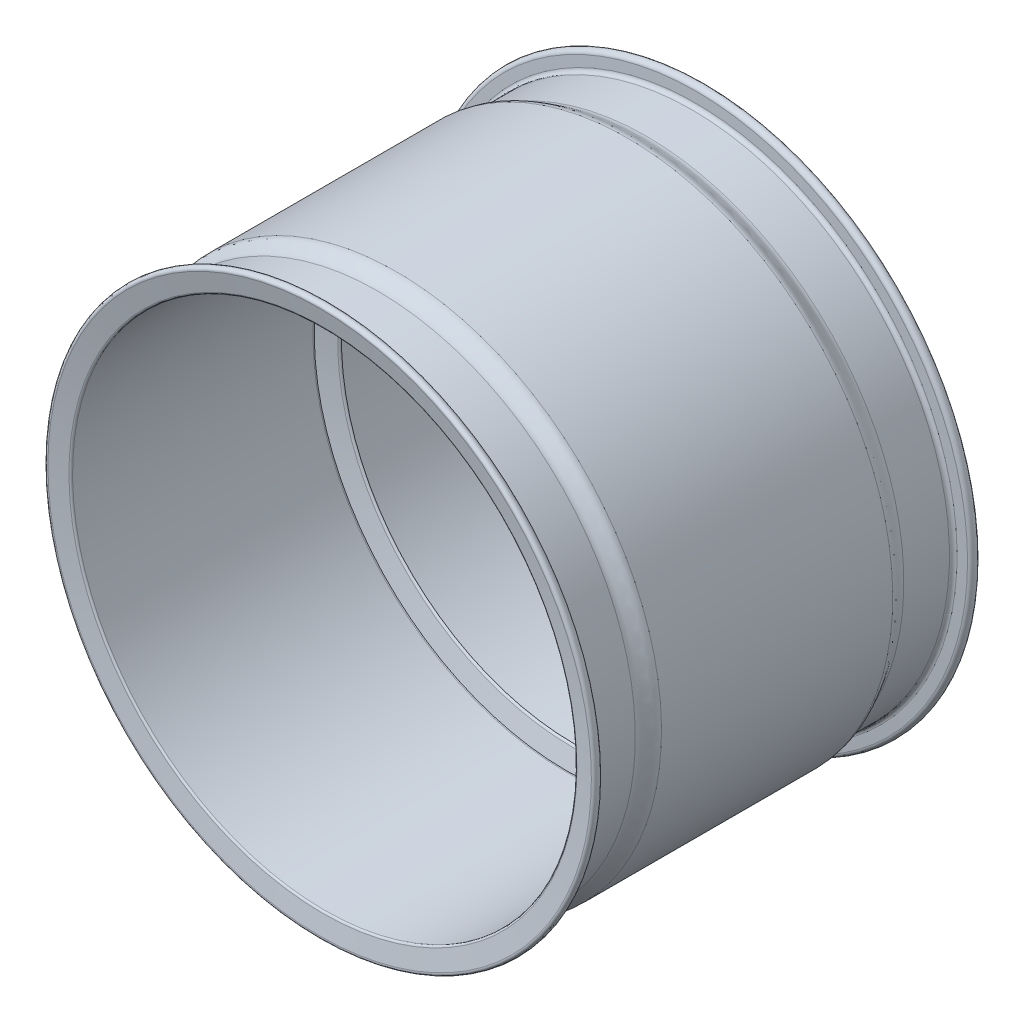
ISO-10303-21;
HEADER;
FILE_DESCRIPTION(('STEP AP214'),'2;1');
FILE_NAME('part.step','',(''),(''),'','','');
FILE_SCHEMA(('AUTOMOTIVE_DESIGN { 1 0 10303 214 1 1 1 1 }'));
ENDSEC;
DATA;
#1=APPLICATION_CONTEXT('core data for automotive mechanical design processes');
#2=APPLICATION_PROTOCOL_DEFINITION('international standard','automotive_design',2000,#1);
#3=PRODUCT_CONTEXT('',#1,'mechanical');
#4=PRODUCT('Part','Part','',(#3));
#5=PRODUCT_RELATED_PRODUCT_CATEGORY('part','',(#4));
#6=PRODUCT_DEFINITION_FORMATION('','',#4);
#7=PRODUCT_DEFINITION_CONTEXT('part definition',#1,'design');
#8=PRODUCT_DEFINITION('design','',#6,#7);
#9=PRODUCT_DEFINITION_SHAPE('','',#8);
#10=(LENGTH_UNIT() NAMED_UNIT(*) SI_UNIT(.MILLI.,.METRE.));
#11=(NAMED_UNIT(*) PLANE_ANGLE_UNIT() SI_UNIT($,.RADIAN.));
#12=(NAMED_UNIT(*) SI_UNIT($,.STERADIAN.) SOLID_ANGLE_UNIT());
#13=UNCERTAINTY_MEASURE_WITH_UNIT(LENGTH_MEASURE(1.E-05),#10,'distance_accuracy_value','');
#14=(GEOMETRIC_REPRESENTATION_CONTEXT(3) GLOBAL_UNCERTAINTY_ASSIGNED_CONTEXT((#13)) GLOBAL_UNIT_ASSIGNED_CONTEXT((#10,
#11,#12)) REPRESENTATION_CONTEXT('',''));
#15=CARTESIAN_POINT('',(0.,0.,0.));
#16=DIRECTION('',(0.,0.,1.));
#17=DIRECTION('',(1.,0.,0.));
#18=AXIS2_PLACEMENT_3D('',#15,#16,#17);
#19=CARTESIAN_POINT('',(-7927.40763591954,2848.66816357867,1107.69743971437));
#20=DIRECTION('',(0.,0.,-1.));
#21=DIRECTION('',(0.,-1.,0.));
#22=AXIS2_PLACEMENT_3D('',#19,#20,#21);
#23=CYLINDRICAL_SURFACE('',#22,872.626729216628);
#24=CARTESIAN_POINT('',(-7927.40763591954,2848.66816357867,313.603993632309));
#25=DIRECTION('',(0.,0.,1.));
#26=DIRECTION('',(0.,-1.,0.));
#27=AXIS2_PLACEMENT_3D('',#24,#25,#26);
#28=CIRCLE('',#27,872.626729216631);
#29=CARTESIAN_POINT('',(-7927.40763591954,1976.04143436204,313.603993632309));
#30=VERTEX_POINT('',#29);
#31=EDGE_CURVE('E10',#30,#30,#28,.T.);
#32=ORIENTED_EDGE('',*,*,#31,.F.);
#33=EDGE_LOOP('',(#32));
#34=FACE_BOUND('',#33,.T.);
#35=CARTESIAN_POINT('',(-7927.40763591954,2848.66816357867,1145.27715660501));
#36=DIRECTION('',(0.,0.,1.));
#37=DIRECTION('',(0.,-1.,0.));
#38=AXIS2_PLACEMENT_3D('',#35,#36,#37);
#39=CIRCLE('',#38,872.626729216626);
#40=CARTESIAN_POINT('',(-7927.40763591954,1976.04143436205,1145.27715660501));
#41=VERTEX_POINT('',#40);
#42=EDGE_CURVE('E217',#41,#41,#39,.T.);
#43=ORIENTED_EDGE('',*,*,#42,.T.);
#44=EDGE_LOOP('',(#43));
#45=FACE_BOUND('',#44,.T.);
#46=ADVANCED_FACE('F15',(#34,#45),#23,.F.);
#47=CARTESIAN_POINT('',(-7927.40763591954,2848.66816357867,313.603993632309));
#48=DIRECTION('',(0.,0.,1.));
#49=DIRECTION('',(0.,1.,0.));
#50=AXIS2_PLACEMENT_3D('',#47,#48,#49);
#51=CONICAL_SURFACE('',#50,872.626729216631,0.0244340149573436);
#52=CARTESIAN_POINT('',(-7927.40763591954,2848.66816357867,309.257603664303));
#53=DIRECTION('',(0.,0.,1.));
#54=DIRECTION('',(0.,-1.,0.));
#55=AXIS2_PLACEMENT_3D('',#52,#53,#54);
#56=CIRCLE('',#55,872.520508319595);
#57=CARTESIAN_POINT('',(-7927.40763591954,1976.14765525908,309.257603664303));
#58=VERTEX_POINT('',#57);
#59=EDGE_CURVE('E21',#58,#58,#56,.T.);
#60=ORIENTED_EDGE('',*,*,#59,.F.);
#61=EDGE_LOOP('',(#60));
#62=FACE_BOUND('',#61,.T.);
#63=ORIENTED_EDGE('',*,*,#31,.T.);
#64=EDGE_LOOP('',(#63));
#65=FACE_BOUND('',#64,.T.);
#66=ADVANCED_FACE('F208',(#62,#65),#51,.F.);
#67=CARTESIAN_POINT('',(-7927.40763591954,2848.66816357867,290.539523024188));
#68=DIRECTION('',(0.,0.,1.));
#69=DIRECTION('',(0.,1.,0.));
#70=AXIS2_PLACEMENT_3D('',#67,#68,#69);
#71=CONICAL_SURFACE('',#70,809.981708308582,1.27997866155326);
#72=ORIENTED_EDGE('',*,*,#59,.T.);
#73=EDGE_LOOP('',(#72));
#74=FACE_BOUND('',#73,.T.);
#75=CARTESIAN_POINT('',(-7927.40763591954,2848.66816357867,290.539523024188));
#76=DIRECTION('',(0.,0.,1.));
#77=DIRECTION('',(0.,-1.,0.));
#78=AXIS2_PLACEMENT_3D('',#75,#76,#77);
#79=CIRCLE('',#78,809.981708308582);
#80=CARTESIAN_POINT('',(-7927.40763591954,2038.68645527009,290.539523024188));
#81=VERTEX_POINT('',#80);
#82=EDGE_CURVE('E25',#81,#81,#79,.T.);
#83=ORIENTED_EDGE('',*,*,#82,.F.);
#84=EDGE_LOOP('',(#83));
#85=FACE_BOUND('',#84,.T.);
#86=ADVANCED_FACE('F139',(#74,#85),#71,.F.);
#87=CARTESIAN_POINT('',(-7927.40763591954,3658.64987188726,290.539523024188));
#88=CARTESIAN_POINT('',(-7927.40763591954,3654.97252343434,289.438879825545));
#89=CARTESIAN_POINT('',(-7927.40763591954,3650.45167821207,283.536212592688));
#90=CARTESIAN_POINT('',(-7927.40763591954,3653.8595859903,282.71538319234));
#91=B_SPLINE_CURVE_WITH_KNOTS('',3,(#87,#88,#89,#90),.UNSPECIFIED.,.F.,.F.,(4,4),(0.,1.),.UNSPECIFIED.);
#92=CARTESIAN_POINT('',(-7927.40763591954,2848.66816357867,1107.69743971437));
#93=DIRECTION('',(0.,0.,-1.));
#94=AXIS1_PLACEMENT('',#92,#93);
#95=SURFACE_OF_REVOLUTION('',#91,#94);
#96=CARTESIAN_POINT('',(-7927.40763591954,2848.66816357867,282.71538319234));
#97=DIRECTION('',(0.,0.,1.));
#98=DIRECTION('',(0.,-1.,0.));
#99=AXIS2_PLACEMENT_3D('',#96,#97,#98);
#100=CIRCLE('',#99,805.191422411616);
#101=CARTESIAN_POINT('',(-7927.40763591954,2043.47674116706,282.71538319234));
#102=VERTEX_POINT('',#101);
#103=EDGE_CURVE('E29',#102,#102,#100,.T.);
#104=ORIENTED_EDGE('',*,*,#103,.F.);
#105=EDGE_LOOP('',(#104));
#106=FACE_BOUND('',#105,.T.);
#107=ORIENTED_EDGE('',*,*,#82,.T.);
#108=EDGE_LOOP('',(#107));
#109=FACE_BOUND('',#108,.T.);
#110=ADVANCED_FACE('F135',(#106,#109),#95,.F.);
#111=CARTESIAN_POINT('',(-7927.40763591954,2848.66816357867,270.937208748419));
#112=DIRECTION('',(0.,0.,-1.));
#113=DIRECTION('',(0.,-1.,0.));
#114=AXIS2_PLACEMENT_3D('',#111,#112,#113);
#115=CONICAL_SURFACE('',#114,854.091878808233,1.33443813978017);
#116=ORIENTED_EDGE('',*,*,#103,.T.);
#117=EDGE_LOOP('',(#116));
#118=FACE_BOUND('',#117,.T.);
#119=CARTESIAN_POINT('',(-7927.40763591954,2848.66816357867,270.937208748419));
#120=DIRECTION('',(0.,0.,1.));
#121=DIRECTION('',(0.,-1.,0.));
#122=AXIS2_PLACEMENT_3D('',#119,#120,#121);
#123=CIRCLE('',#122,854.091878808233);
#124=CARTESIAN_POINT('',(-7927.40763591954,1994.57628477044,270.937208748419));
#125=VERTEX_POINT('',#124);
#126=EDGE_CURVE('E34',#125,#125,#123,.T.);
#127=ORIENTED_EDGE('',*,*,#126,.F.);
#128=EDGE_LOOP('',(#127));
#129=FACE_BOUND('',#128,.T.);
#130=ADVANCED_FACE('F131',(#118,#129),#115,.F.);
#131=CARTESIAN_POINT('',(-7927.40763591954,3702.76004238691,270.937208748419));
#132=CARTESIAN_POINT('',(-7927.40763591954,3712.77494822842,268.525016373697));
#133=CARTESIAN_POINT('',(-7927.40763591954,3721.2948927953,261.567860627973));
#134=CARTESIAN_POINT('',(-7927.40763591954,3721.2948927953,252.007999820701));
#135=B_SPLINE_CURVE_WITH_KNOTS('',3,(#131,#132,#133,#134),.UNSPECIFIED.,.F.,.F.,(4,4),(0.,1.),.UNSPECIFIED.);
#136=CARTESIAN_POINT('',(-7927.40763591954,2848.66816357867,1107.69743971437));
#137=DIRECTION('',(0.,0.,-1.));
#138=AXIS1_PLACEMENT('',#136,#137);
#139=SURFACE_OF_REVOLUTION('',#135,#138);
#140=CARTESIAN_POINT('',(-7927.40763591954,2848.66816357867,252.007999820701));
#141=DIRECTION('',(0.,0.,1.));
#142=DIRECTION('',(0.,-1.,0.));
#143=AXIS2_PLACEMENT_3D('',#140,#141,#142);
#144=CIRCLE('',#143,872.626729216628);
#145=CARTESIAN_POINT('',(-7927.40763591954,1976.04143436205,252.007999820701));
#146=VERTEX_POINT('',#145);
#147=EDGE_CURVE('E37',#146,#146,#144,.T.);
#148=ORIENTED_EDGE('',*,*,#147,.F.);
#149=EDGE_LOOP('',(#148));
#150=FACE_BOUND('',#149,.T.);
#151=ORIENTED_EDGE('',*,*,#126,.T.);
#152=EDGE_LOOP('',(#151));
#153=FACE_BOUND('',#152,.T.);
#154=ADVANCED_FACE('F127',(#150,#153),#139,.F.);
#155=CARTESIAN_POINT('',(-7927.40763591954,2848.66816357867,1107.69743971437));
#156=DIRECTION('',(0.,0.,-1.));
#157=DIRECTION('',(0.,-1.,0.));
#158=AXIS2_PLACEMENT_3D('',#155,#156,#157);
#159=CYLINDRICAL_SURFACE('',#158,872.626729216626);
#160=CARTESIAN_POINT('',(-7927.40763591954,2848.66816357867,-149.90753450565));
#161=DIRECTION('',(0.,0.,1.));
#162=DIRECTION('',(0.,-1.,0.));
#163=AXIS2_PLACEMENT_3D('',#160,#161,#162);
#164=CIRCLE('',#163,872.626729216624);
#165=CARTESIAN_POINT('',(-7927.40763591954,1976.04143436205,-149.90753450565));
#166=VERTEX_POINT('',#165);
#167=EDGE_CURVE('E40',#166,#166,#164,.T.);
#168=ORIENTED_EDGE('',*,*,#167,.F.);
#169=EDGE_LOOP('',(#168));
#170=FACE_BOUND('',#169,.T.);
#171=ORIENTED_EDGE('',*,*,#147,.T.);
#172=EDGE_LOOP('',(#171));
#173=FACE_BOUND('',#172,.T.);
#174=ADVANCED_FACE('F123',(#170,#173),#159,.F.);
#175=CARTESIAN_POINT('',(-7927.40763591954,3727.32924383285,-156.358850884272));
#176=CARTESIAN_POINT('',(-7927.40763591954,3723.98355823629,-155.734322906248));
#177=CARTESIAN_POINT('',(-7927.40763591954,3721.2948927953,-153.169237991303));
#178=CARTESIAN_POINT('',(-7927.40763591954,3721.2948927953,-149.90753450565));
#179=B_SPLINE_CURVE_WITH_KNOTS('',3,(#175,#176,#177,#178),.UNSPECIFIED.,.F.,.F.,(4,4),(0.,1.),.UNSPECIFIED.);
#180=CARTESIAN_POINT('',(-7927.40763591954,2848.66816357867,1107.69743971437));
#181=DIRECTION('',(0.,0.,-1.));
#182=AXIS1_PLACEMENT('',#180,#181);
#183=SURFACE_OF_REVOLUTION('',#179,#182);
#184=ORIENTED_EDGE('',*,*,#167,.T.);
#185=EDGE_LOOP('',(#184));
#186=FACE_BOUND('',#185,.T.);
#187=CARTESIAN_POINT('',(-7927.40763591954,2848.66816357867,-156.358850884272));
#188=DIRECTION('',(0.,0.,1.));
#189=DIRECTION('',(0.,-1.,0.));
#190=AXIS2_PLACEMENT_3D('',#187,#188,#189);
#191=CIRCLE('',#190,878.661080254166);
#192=CARTESIAN_POINT('',(-7927.40763591954,1970.00708332451,-156.358850884272));
#193=VERTEX_POINT('',#192);
#194=EDGE_CURVE('E43',#193,#193,#191,.T.);
#195=ORIENTED_EDGE('',*,*,#194,.F.);
#196=EDGE_LOOP('',(#195));
#197=FACE_BOUND('',#196,.T.);
#198=ADVANCED_FACE('F120',(#186,#197),#183,.T.);
#199=CARTESIAN_POINT('',(-7927.40763591954,2848.66816357867,-156.358850884272));
#200=DIRECTION('',(0.,0.,-1.));
#201=DIRECTION('',(0.,-1.,0.));
#202=AXIS2_PLACEMENT_3D('',#199,#200,#201);
#203=CONICAL_SURFACE('',#202,878.661080254166,1.38625352960428);
#204=CARTESIAN_POINT('',(-7927.40763591954,2848.66816357867,-167.815188950199));
#205=DIRECTION('',(0.,0.,1.));
#206=DIRECTION('',(0.,-1.,0.));
#207=AXIS2_PLACEMENT_3D('',#204,#205,#206);
#208=CIRCLE('',#207,940.034319893063);
#209=CARTESIAN_POINT('',(-7927.40763591954,1908.63384368561,-167.815188950199));
#210=VERTEX_POINT('',#209);
#211=EDGE_CURVE('E46',#210,#210,#208,.T.);
#212=ORIENTED_EDGE('',*,*,#211,.F.);
#213=EDGE_LOOP('',(#212));
#214=FACE_BOUND('',#213,.T.);
#215=ORIENTED_EDGE('',*,*,#194,.T.);
#216=EDGE_LOOP('',(#215));
#217=FACE_BOUND('',#216,.T.);
#218=ADVANCED_FACE('F99',(#214,#217),#203,.F.);
#219=CARTESIAN_POINT('',(-7927.40763591954,3787.38225023844,-139.523187611277));
#220=CARTESIAN_POINT('',(-7927.40763591954,3805.32306820624,-140.434467254083));
#221=CARTESIAN_POINT('',(-7927.40763591954,3805.61899329388,-170.972937450326));
#222=CARTESIAN_POINT('',(-7927.40763591954,3788.70248347174,-167.815188950199));
#223=B_SPLINE_CURVE_WITH_KNOTS('',3,(#219,#220,#221,#222),.UNSPECIFIED.,.F.,.F.,(4,4),(0.,1.),.UNSPECIFIED.);
#224=CARTESIAN_POINT('',(-7927.40763591954,2848.66816357867,1107.69743971437));
#225=DIRECTION('',(0.,0.,-1.));
#226=AXIS1_PLACEMENT('',#224,#225);
#227=SURFACE_OF_REVOLUTION('',#223,#226);
#228=ORIENTED_EDGE('',*,*,#211,.T.);
#229=EDGE_LOOP('',(#228));
#230=FACE_BOUND('',#229,.T.);
#231=CARTESIAN_POINT('',(-7927.40763591954,2848.66816357867,-139.523187611277));
#232=DIRECTION('',(0.,0.,1.));
#233=DIRECTION('',(0.,-1.,0.));
#234=AXIS2_PLACEMENT_3D('',#231,#232,#233);
#235=CIRCLE('',#234,938.714086659763);
#236=CARTESIAN_POINT('',(-7927.40763591954,1909.95407691891,-139.523187611277));
#237=VERTEX_POINT('',#236);
#238=EDGE_CURVE('E49',#237,#237,#235,.T.);
#239=ORIENTED_EDGE('',*,*,#238,.F.);
#240=EDGE_LOOP('',(#239));
#241=FACE_BOUND('',#240,.T.);
#242=ADVANCED_FACE('F95',(#230,#241),#227,.T.);
#243=CARTESIAN_POINT('',(-7927.40763591954,2848.66816357867,-139.523187611277));
#244=DIRECTION('',(0.,0.,-1.));
#245=DIRECTION('',(0.,-1.,0.));
#246=AXIS2_PLACEMENT_3D('',#243,#244,#245);
#247=CONICAL_SURFACE('',#246,938.714086659763,1.52004629095966);
#248=CARTESIAN_POINT('',(-7927.40763591954,2848.66816357867,-137.770631838097));
#249=DIRECTION('',(0.,0.,1.));
#250=DIRECTION('',(0.,-1.,0.));
#251=AXIS2_PLACEMENT_3D('',#248,#249,#250);
#252=CIRCLE('',#251,904.210644875272);
#253=CARTESIAN_POINT('',(-7927.40763591954,1944.4575187034,-137.770631838097));
#254=VERTEX_POINT('',#253);
#255=EDGE_CURVE('E52',#254,#254,#252,.T.);
#256=ORIENTED_EDGE('',*,*,#255,.F.);
#257=EDGE_LOOP('',(#256));
#258=FACE_BOUND('',#257,.T.);
#259=ORIENTED_EDGE('',*,*,#238,.T.);
#260=EDGE_LOOP('',(#259));
#261=FACE_BOUND('',#260,.T.);
#262=ADVANCED_FACE('F91',(#258,#261),#247,.T.);
#263=CARTESIAN_POINT('',(-7927.40763591954,3739.73464015509,-124.501280984016));
#264=CARTESIAN_POINT('',(-7927.40763591954,3739.73464015509,-131.661971573417));
#265=CARTESIAN_POINT('',(-7927.40763591954,3745.60846408455,-137.401344505042));
#266=CARTESIAN_POINT('',(-7927.40763591954,3752.87880845395,-137.770631838097));
#267=B_SPLINE_CURVE_WITH_KNOTS('',3,(#263,#264,#265,#266),.UNSPECIFIED.,.F.,.F.,(4,4),(0.,1.),.UNSPECIFIED.);
#268=CARTESIAN_POINT('',(-7927.40763591954,2848.66816357867,1107.69743971437));
#269=DIRECTION('',(0.,0.,-1.));
#270=AXIS1_PLACEMENT('',#268,#269);
#271=SURFACE_OF_REVOLUTION('',#267,#270);
#272=ORIENTED_EDGE('',*,*,#255,.T.);
#273=EDGE_LOOP('',(#272));
#274=FACE_BOUND('',#273,.T.);
#275=CARTESIAN_POINT('',(-7927.40763591954,2848.66816357867,-124.501280984016));
#276=DIRECTION('',(0.,0.,1.));
#277=DIRECTION('',(0.,-1.,0.));
#278=AXIS2_PLACEMENT_3D('',#275,#276,#277);
#279=CIRCLE('',#278,891.066476576418);
#280=CARTESIAN_POINT('',(-7927.40763591954,1957.60168700226,-124.501280984016));
#281=VERTEX_POINT('',#280);
#282=EDGE_CURVE('E55',#281,#281,#279,.T.);
#283=ORIENTED_EDGE('',*,*,#282,.F.);
#284=EDGE_LOOP('',(#283));
#285=FACE_BOUND('',#284,.T.);
#286=ADVANCED_FACE('F87',(#274,#285),#271,.T.);
#287=CARTESIAN_POINT('',(-7927.40763591954,2848.66816357867,1107.69743971437));
#288=DIRECTION('',(0.,0.,-1.));
#289=DIRECTION('',(0.,-1.,0.));
#290=AXIS2_PLACEMENT_3D('',#287,#288,#289);
#291=CYLINDRICAL_SURFACE('',#290,891.066476576418);
#292=CARTESIAN_POINT('',(-7927.40763591954,2848.66816357867,33.2786751773391));
#293=DIRECTION('',(0.,0.,1.));
#294=DIRECTION('',(0.,-1.,0.));
#295=AXIS2_PLACEMENT_3D('',#292,#293,#294);
#296=CIRCLE('',#295,891.066476576417);
#297=CARTESIAN_POINT('',(-7927.40763591954,1957.60168700226,33.2786751773391));
#298=VERTEX_POINT('',#297);
#299=EDGE_CURVE('E58',#298,#298,#296,.T.);
#300=ORIENTED_EDGE('',*,*,#299,.F.);
#301=EDGE_LOOP('',(#300));
#302=FACE_BOUND('',#301,.T.);
#303=ORIENTED_EDGE('',*,*,#282,.T.);
#304=EDGE_LOOP('',(#303));
#305=FACE_BOUND('',#304,.T.);
#306=ADVANCED_FACE('F82',(#302,#305),#291,.T.);
#307=CARTESIAN_POINT('',(-7927.40763591954,3765.8435271157,97.6467911776693));
#308=CARTESIAN_POINT('',(-7927.40763591954,3765.8435271157,73.6116479770272));
#309=CARTESIAN_POINT('',(-7927.40763591954,3739.73464015509,57.313818377982));
#310=CARTESIAN_POINT('',(-7927.40763591954,3739.73464015509,33.2786751773391));
#311=B_SPLINE_CURVE_WITH_KNOTS('',3,(#307,#308,#309,#310),.UNSPECIFIED.,.F.,.F.,(4,4),(0.,1.),.UNSPECIFIED.);
#312=CARTESIAN_POINT('',(-7927.40763591954,2848.66816357867,1107.69743971437));
#313=DIRECTION('',(0.,0.,-1.));
#314=AXIS1_PLACEMENT('',#312,#313);
#315=SURFACE_OF_REVOLUTION('',#311,#314);
#316=ORIENTED_EDGE('',*,*,#299,.T.);
#317=EDGE_LOOP('',(#316));
#318=FACE_BOUND('',#317,.T.);
#319=CARTESIAN_POINT('',(-7927.40763591954,2848.66816357867,97.6467911776693));
#320=DIRECTION('',(0.,0.,1.));
#321=DIRECTION('',(0.,-1.,0.));
#322=AXIS2_PLACEMENT_3D('',#319,#320,#321);
#323=CIRCLE('',#322,917.175363537015);
#324=CARTESIAN_POINT('',(-7927.40763591954,1931.49280004166,97.6467911776693));
#325=VERTEX_POINT('',#324);
#326=EDGE_CURVE('E61',#325,#325,#323,.T.);
#327=ORIENTED_EDGE('',*,*,#326,.F.);
#328=EDGE_LOOP('',(#327));
#329=FACE_BOUND('',#328,.T.);
#330=ADVANCED_FACE('F77',(#318,#329),#315,.T.);
#331=CARTESIAN_POINT('',(-7927.40763591954,2848.66816357867,1107.69743971437));
#332=DIRECTION('',(0.,0.,-1.));
#333=DIRECTION('',(0.,-1.,0.));
#334=AXIS2_PLACEMENT_3D('',#331,#332,#333);
#335=CYLINDRICAL_SURFACE('',#334,917.175363537016);
#336=ORIENTED_EDGE('',*,*,#326,.T.);
#337=EDGE_LOOP('',(#336));
#338=FACE_BOUND('',#337,.T.);
#339=CARTESIAN_POINT('',(-7927.40763591954,2848.66816357867,897.722830921689));
#340=DIRECTION('',(0.,0.,1.));
#341=DIRECTION('',(0.,-1.,0.));
#342=AXIS2_PLACEMENT_3D('',#339,#340,#341);
#343=CIRCLE('',#342,917.175363537016);
#344=CARTESIAN_POINT('',(-7927.40763591954,1931.49280004166,897.722830921689));
#345=VERTEX_POINT('',#344);
#346=EDGE_CURVE('E64',#345,#345,#343,.T.);
#347=ORIENTED_EDGE('',*,*,#346,.F.);
#348=EDGE_LOOP('',(#347));
#349=FACE_BOUND('',#348,.T.);
#350=ADVANCED_FACE('F81',(#338,#349),#335,.T.);
#351=CARTESIAN_POINT('',(-7927.40763591954,3787.38225023844,1134.89280971063));
#352=CARTESIAN_POINT('',(-7927.40763591954,3805.32306820624,1135.80408935344));
#353=CARTESIAN_POINT('',(-7927.40763591954,3805.61899329388,1166.34255954969));
#354=CARTESIAN_POINT('',(-7927.40763591954,3788.70248347175,1163.18481104956));
#355=B_SPLINE_CURVE_WITH_KNOTS('',3,(#351,#352,#353,#354),.UNSPECIFIED.,.F.,.F.,(4,4),(0.,1.),.UNSPECIFIED.);
#356=CARTESIAN_POINT('',(-7927.40763591954,2848.66816357867,1475.8590745491));
#357=DIRECTION('',(0.,0.,-1.));
#358=AXIS1_PLACEMENT('',#356,#357);
#359=SURFACE_OF_REVOLUTION('',#355,#358);
#360=CARTESIAN_POINT('',(-7927.40763591954,2848.66816357867,1163.18481104956));
#361=DIRECTION('',(0.,0.,1.));
#362=DIRECTION('',(0.,-1.,0.));
#363=AXIS2_PLACEMENT_3D('',#360,#361,#362);
#364=CIRCLE('',#363,940.034319893066);
#365=CARTESIAN_POINT('',(-7927.40763591954,1908.63384368561,1163.18481104956));
#366=VERTEX_POINT('',#365);
#367=EDGE_CURVE('E223',#366,#366,#364,.T.);
#368=ORIENTED_EDGE('',*,*,#367,.F.);
#369=EDGE_LOOP('',(#368));
#370=FACE_BOUND('',#369,.T.);
#371=CARTESIAN_POINT('',(-7927.40763591954,2848.66816357867,1134.89280971063));
#372=DIRECTION('',(0.,0.,1.));
#373=DIRECTION('',(0.,-1.,0.));
#374=AXIS2_PLACEMENT_3D('',#371,#372,#373);
#375=CIRCLE('',#374,938.714086659766);
#376=CARTESIAN_POINT('',(-7927.40763591954,1909.95407691891,1134.89280971063));
#377=VERTEX_POINT('',#376);
#378=EDGE_CURVE('E190',#377,#377,#375,.T.);
#379=ORIENTED_EDGE('',*,*,#378,.T.);
#380=EDGE_LOOP('',(#379));
#381=FACE_BOUND('',#380,.T.);
#382=ADVANCED_FACE('F195',(#370,#381),#359,.F.);
#383=CARTESIAN_POINT('',(-7927.40763591954,2848.66816357867,1151.72847298362));
#384=DIRECTION('',(0.,0.,1.));
#385=DIRECTION('',(0.,1.,0.));
#386=AXIS2_PLACEMENT_3D('',#383,#384,#385);
#387=CONICAL_SURFACE('',#386,878.661080254167,1.38625352960428);
#388=ORIENTED_EDGE('',*,*,#367,.T.);
#389=EDGE_LOOP('',(#388));
#390=FACE_BOUND('',#389,.T.);
#391=CARTESIAN_POINT('',(-7927.40763591954,2848.66816357867,1151.72847298362));
#392=DIRECTION('',(0.,0.,1.));
#393=DIRECTION('',(0.,-1.,0.));
#394=AXIS2_PLACEMENT_3D('',#391,#392,#393);
#395=CIRCLE('',#394,878.661080254167);
#396=CARTESIAN_POINT('',(-7927.40763591954,1970.00708332451,1151.72847298362));
#397=VERTEX_POINT('',#396);
#398=EDGE_CURVE('E218',#397,#397,#395,.T.);
#399=ORIENTED_EDGE('',*,*,#398,.F.);
#400=EDGE_LOOP('',(#399));
#401=FACE_BOUND('',#400,.T.);
#402=ADVANCED_FACE('F165',(#390,#401),#387,.F.);
#403=CARTESIAN_POINT('',(-7927.40763591954,3727.32924383285,1151.72847298362));
#404=CARTESIAN_POINT('',(-7927.40763591954,3723.98355823629,1151.1039450056));
#405=CARTESIAN_POINT('',(-7927.40763591954,3721.2948927953,1148.53886009065));
#406=CARTESIAN_POINT('',(-7927.40763591954,3721.2948927953,1145.27715660501));
#407=B_SPLINE_CURVE_WITH_KNOTS('',3,(#403,#404,#405,#406),.UNSPECIFIED.,.F.,.F.,(4,4),(0.,1.),.UNSPECIFIED.);
#408=CARTESIAN_POINT('',(-7927.40763591954,2848.66816357867,1475.8590745491));
#409=DIRECTION('',(0.,0.,-1.));
#410=AXIS1_PLACEMENT('',#408,#409);
#411=SURFACE_OF_REVOLUTION('',#407,#410);
#412=ORIENTED_EDGE('',*,*,#42,.F.);
#413=EDGE_LOOP('',(#412));
#414=FACE_BOUND('',#413,.T.);
#415=ORIENTED_EDGE('',*,*,#398,.T.);
#416=EDGE_LOOP('',(#415));
#417=FACE_BOUND('',#416,.T.);
#418=ADVANCED_FACE('F160',(#414,#417),#411,.F.);
#419=CARTESIAN_POINT('',(-7927.40763591954,2848.66816357867,1134.89280971063));
#420=DIRECTION('',(0.,0.,1.));
#421=DIRECTION('',(0.,1.,0.));
#422=AXIS2_PLACEMENT_3D('',#419,#420,#421);
#423=CONICAL_SURFACE('',#422,938.714086659766,1.52004629095967);
#424=CARTESIAN_POINT('',(-7927.40763591954,2848.66816357867,1133.14025393745));
#425=DIRECTION('',(0.,0.,1.));
#426=DIRECTION('',(0.,-1.,0.));
#427=AXIS2_PLACEMENT_3D('',#424,#425,#426);
#428=CIRCLE('',#427,904.210644875274);
#429=CARTESIAN_POINT('',(-7927.40763591954,1944.4575187034,1133.14025393745));
#430=VERTEX_POINT('',#429);
#431=EDGE_CURVE('E221',#430,#430,#428,.T.);
#432=ORIENTED_EDGE('',*,*,#431,.T.);
#433=EDGE_LOOP('',(#432));
#434=FACE_BOUND('',#433,.T.);
#435=ORIENTED_EDGE('',*,*,#378,.F.);
#436=EDGE_LOOP('',(#435));
#437=FACE_BOUND('',#436,.T.);
#438=ADVANCED_FACE('F164',(#434,#437),#423,.T.);
#439=CARTESIAN_POINT('',(-7927.40763591954,3739.7346401551,1119.87090308337));
#440=CARTESIAN_POINT('',(-7927.40763591954,3739.7346401551,1127.03159367277));
#441=CARTESIAN_POINT('',(-7927.40763591954,3745.60846408455,1132.7709666044));
#442=CARTESIAN_POINT('',(-7927.40763591954,3752.87880845395,1133.14025393745));
#443=B_SPLINE_CURVE_WITH_KNOTS('',3,(#439,#440,#441,#442),.UNSPECIFIED.,.F.,.F.,(4,4),(0.,1.),.UNSPECIFIED.);
#444=CARTESIAN_POINT('',(-7927.40763591954,2848.66816357867,1475.8590745491));
#445=DIRECTION('',(0.,0.,-1.));
#446=AXIS1_PLACEMENT('',#444,#445);
#447=SURFACE_OF_REVOLUTION('',#443,#446);
#448=ORIENTED_EDGE('',*,*,#431,.F.);
#449=EDGE_LOOP('',(#448));
#450=FACE_BOUND('',#449,.T.);
#451=CARTESIAN_POINT('',(-7927.40763591954,2848.66816357867,1119.87090308337));
#452=DIRECTION('',(0.,0.,1.));
#453=DIRECTION('',(0.,-1.,0.));
#454=AXIS2_PLACEMENT_3D('',#451,#452,#453);
#455=CIRCLE('',#454,891.066476576421);
#456=CARTESIAN_POINT('',(-7927.40763591954,1957.60168700225,1119.87090308337));
#457=VERTEX_POINT('',#456);
#458=EDGE_CURVE('E232',#457,#457,#455,.T.);
#459=ORIENTED_EDGE('',*,*,#458,.T.);
#460=EDGE_LOOP('',(#459));
#461=FACE_BOUND('',#460,.T.);
#462=ADVANCED_FACE('F175',(#450,#461),#447,.F.);
#463=CARTESIAN_POINT('',(-7927.40763591954,2848.66816357867,1475.8590745491));
#464=DIRECTION('',(0.,0.,-1.));
#465=DIRECTION('',(0.,-1.,0.));
#466=AXIS2_PLACEMENT_3D('',#463,#464,#465);
#467=CYLINDRICAL_SURFACE('',#466,891.06647657642);
#468=CARTESIAN_POINT('',(-7927.40763591954,2848.66816357867,962.090946922013));
#469=DIRECTION('',(0.,0.,1.));
#470=DIRECTION('',(0.,-1.,0.));
#471=AXIS2_PLACEMENT_3D('',#468,#469,#470);
#472=CIRCLE('',#471,891.066476576418);
#473=CARTESIAN_POINT('',(-7927.40763591954,1957.60168700226,962.090946922013));
#474=VERTEX_POINT('',#473);
#475=EDGE_CURVE('E229',#474,#474,#472,.T.);
#476=ORIENTED_EDGE('',*,*,#475,.T.);
#477=EDGE_LOOP('',(#476));
#478=FACE_BOUND('',#477,.T.);
#479=ORIENTED_EDGE('',*,*,#458,.F.);
#480=EDGE_LOOP('',(#479));
#481=FACE_BOUND('',#480,.T.);
#482=ADVANCED_FACE('F171',(#478,#481),#467,.T.);
#483=CARTESIAN_POINT('',(-7927.40763591954,3765.8435271157,897.722830921689));
#484=CARTESIAN_POINT('',(-7927.40763591954,3765.8435271157,921.757974122328));
#485=CARTESIAN_POINT('',(-7927.40763591954,3739.73464015509,938.055803721374));
#486=CARTESIAN_POINT('',(-7927.40763591954,3739.73464015509,962.090946922013));
#487=B_SPLINE_CURVE_WITH_KNOTS('',3,(#483,#484,#485,#486),.UNSPECIFIED.,.F.,.F.,(4,4),(0.,1.),.UNSPECIFIED.);
#488=CARTESIAN_POINT('',(-7927.40763591954,2848.66816357867,1475.8590745491));
#489=DIRECTION('',(0.,0.,-1.));
#490=AXIS1_PLACEMENT('',#488,#489);
#491=SURFACE_OF_REVOLUTION('',#487,#490);
#492=ORIENTED_EDGE('',*,*,#475,.F.);
#493=EDGE_LOOP('',(#492));
#494=FACE_BOUND('',#493,.T.);
#495=ORIENTED_EDGE('',*,*,#346,.T.);
#496=EDGE_LOOP('',(#495));
#497=FACE_BOUND('',#496,.T.);
#498=ADVANCED_FACE('F168',(#494,#497),#491,.F.);
#499=CLOSED_SHELL('',(#46,#66,#86,#110,#130,#154,#174,#198,#218,#242,#262,#286,#306,#330,#350,
#382,#402,#418,#438,#462,#482,#498));
#500=MANIFOLD_SOLID_BREP('B1',#499);
#501=ADVANCED_BREP_SHAPE_REPRESENTATION('',(#18,#500),#14);
#502=SHAPE_DEFINITION_REPRESENTATION(#9,#501);
ENDSEC;
END-ISO-10303-21;
